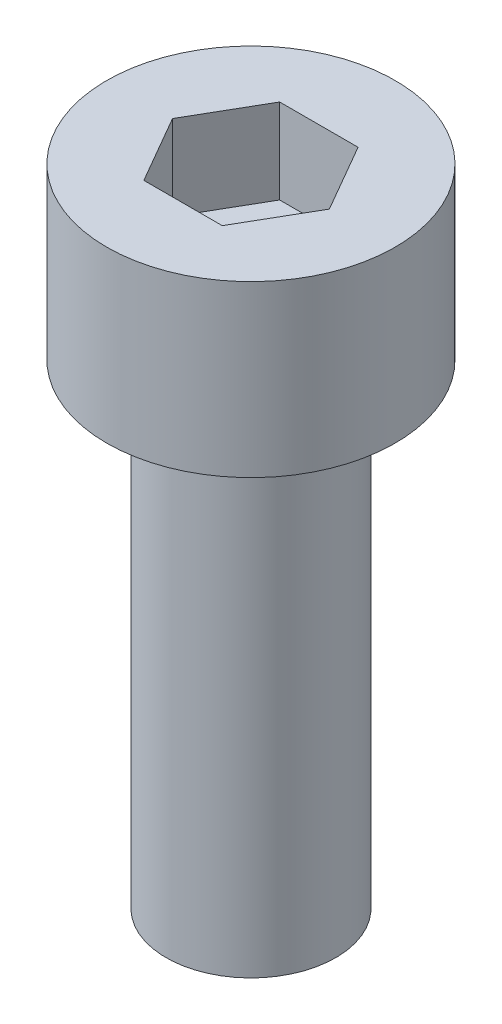
ISO-10303-21;
HEADER;
FILE_DESCRIPTION(('STEP AP214'),'2;1');
FILE_NAME('part.step','',(''),(''),'','','');
FILE_SCHEMA(('AUTOMOTIVE_DESIGN { 1 0 10303 214 1 1 1 1 }'));
ENDSEC;
DATA;
#1=APPLICATION_CONTEXT('core data for automotive mechanical design processes');
#2=APPLICATION_PROTOCOL_DEFINITION('international standard','automotive_design',2000,#1);
#3=PRODUCT_CONTEXT('',#1,'mechanical');
#4=PRODUCT('Part','Part','',(#3));
#5=PRODUCT_RELATED_PRODUCT_CATEGORY('part','',(#4));
#6=PRODUCT_DEFINITION_FORMATION('','',#4);
#7=PRODUCT_DEFINITION_CONTEXT('part definition',#1,'design');
#8=PRODUCT_DEFINITION('design','',#6,#7);
#9=PRODUCT_DEFINITION_SHAPE('','',#8);
#10=(LENGTH_UNIT() NAMED_UNIT(*) SI_UNIT(.MILLI.,.METRE.));
#11=(NAMED_UNIT(*) PLANE_ANGLE_UNIT() SI_UNIT($,.RADIAN.));
#12=(NAMED_UNIT(*) SI_UNIT($,.STERADIAN.) SOLID_ANGLE_UNIT());
#13=UNCERTAINTY_MEASURE_WITH_UNIT(LENGTH_MEASURE(1.E-05),#10,'distance_accuracy_value','');
#14=(GEOMETRIC_REPRESENTATION_CONTEXT(3) GLOBAL_UNCERTAINTY_ASSIGNED_CONTEXT((#13)) GLOBAL_UNIT_ASSIGNED_CONTEXT((#10,
#11,#12)) REPRESENTATION_CONTEXT('',''));
#15=CARTESIAN_POINT('',(0.,0.,0.));
#16=DIRECTION('',(0.,0.,1.));
#17=DIRECTION('',(1.,0.,0.));
#18=AXIS2_PLACEMENT_3D('',#15,#16,#17);
#19=CARTESIAN_POINT('',(0.,5.,0.));
#20=DIRECTION('',(0.,-1.,0.));
#21=DIRECTION('',(0.,0.,-1.));
#22=AXIS2_PLACEMENT_3D('',#19,#20,#21);
#23=CYLINDRICAL_SURFACE('',#22,4.25);
#24=CARTESIAN_POINT('',(0.,5.,0.));
#25=DIRECTION('',(0.,1.,0.));
#26=DIRECTION('',(0.,0.,1.));
#27=AXIS2_PLACEMENT_3D('',#24,#25,#26);
#28=CIRCLE('',#27,4.25);
#29=CARTESIAN_POINT('',(0.,5.,4.25));
#30=VERTEX_POINT('',#29);
#31=EDGE_CURVE('E43',#30,#30,#28,.T.);
#32=ORIENTED_EDGE('',*,*,#31,.F.);
#33=EDGE_LOOP('',(#32));
#34=FACE_BOUND('',#33,.T.);
#35=CARTESIAN_POINT('',(0.,0.,0.));
#36=DIRECTION('',(0.,1.,0.));
#37=DIRECTION('',(0.,0.,1.));
#38=AXIS2_PLACEMENT_3D('',#35,#36,#37);
#39=CIRCLE('',#38,4.25);
#40=CARTESIAN_POINT('',(0.,0.,4.25));
#41=VERTEX_POINT('',#40);
#42=EDGE_CURVE('E38',#41,#41,#39,.T.);
#43=ORIENTED_EDGE('',*,*,#42,.T.);
#44=EDGE_LOOP('',(#43));
#45=FACE_BOUND('',#44,.T.);
#46=ADVANCED_FACE('F35',(#34,#45),#23,.T.);
#47=CARTESIAN_POINT('',(0.,5.,0.));
#48=DIRECTION('',(0.,1.,0.));
#49=DIRECTION('',(0.,0.,1.));
#50=AXIS2_PLACEMENT_3D('',#47,#48,#49);
#51=PLANE('',#50);
#52=DIRECTION('',(0.5,0.,-0.866025403784439));
#53=VECTOR('',#52,1.);
#54=CARTESIAN_POINT('',(1.15470053837925,5.,2.));
#55=LINE('',#54,#53);
#56=CARTESIAN_POINT('',(1.15470053837925,5.,2.));
#57=VERTEX_POINT('',#56);
#58=CARTESIAN_POINT('',(2.3094010767585,5.,0.));
#59=VERTEX_POINT('',#58);
#60=EDGE_CURVE('E51',#57,#59,#55,.T.);
#61=ORIENTED_EDGE('',*,*,#60,.F.);
#62=DIRECTION('',(1.,0.,0.));
#63=VECTOR('',#62,1.);
#64=CARTESIAN_POINT('',(-1.15470053837925,5.,2.));
#65=LINE('',#64,#63);
#66=CARTESIAN_POINT('',(-1.15470053837925,5.,2.));
#67=VERTEX_POINT('',#66);
#68=EDGE_CURVE('E135',#67,#57,#65,.T.);
#69=ORIENTED_EDGE('',*,*,#68,.F.);
#70=DIRECTION('',(0.5,0.,0.866025403784438));
#71=VECTOR('',#70,1.);
#72=CARTESIAN_POINT('',(-2.3094010767585,5.,0.));
#73=LINE('',#72,#71);
#74=CARTESIAN_POINT('',(-2.3094010767585,5.,0.));
#75=VERTEX_POINT('',#74);
#76=EDGE_CURVE('E133',#75,#67,#73,.T.);
#77=ORIENTED_EDGE('',*,*,#76,.F.);
#78=DIRECTION('',(-0.5,0.,0.866025403784439));
#79=VECTOR('',#78,1.);
#80=CARTESIAN_POINT('',(-1.15470053837925,5.,-2.));
#81=LINE('',#80,#79);
#82=CARTESIAN_POINT('',(-1.15470053837925,5.,-2.));
#83=VERTEX_POINT('',#82);
#84=EDGE_CURVE('E99',#83,#75,#81,.T.);
#85=ORIENTED_EDGE('',*,*,#84,.F.);
#86=DIRECTION('',(-1.,0.,0.));
#87=VECTOR('',#86,1.);
#88=CARTESIAN_POINT('',(1.15470053837925,5.,-2.));
#89=LINE('',#88,#87);
#90=CARTESIAN_POINT('',(1.15470053837925,5.,-2.));
#91=VERTEX_POINT('',#90);
#92=EDGE_CURVE('E129',#91,#83,#89,.T.);
#93=ORIENTED_EDGE('',*,*,#92,.F.);
#94=DIRECTION('',(-0.5,0.,-0.866025403784438));
#95=VECTOR('',#94,1.);
#96=CARTESIAN_POINT('',(2.3094010767585,5.,0.));
#97=LINE('',#96,#95);
#98=EDGE_CURVE('E125',#59,#91,#97,.T.);
#99=ORIENTED_EDGE('',*,*,#98,.F.);
#100=EDGE_LOOP('',(#61,#69,#77,#85,#93,#99));
#101=FACE_BOUND('',#100,.T.);
#102=ORIENTED_EDGE('',*,*,#31,.T.);
#103=EDGE_LOOP('',(#102));
#104=FACE_BOUND('',#103,.T.);
#105=ADVANCED_FACE('F153',(#101,#104),#51,.T.);
#106=CARTESIAN_POINT('',(0.,0.,0.));
#107=DIRECTION('',(0.,1.,0.));
#108=DIRECTION('',(0.,0.,1.));
#109=AXIS2_PLACEMENT_3D('',#106,#107,#108);
#110=PLANE('',#109);
#111=CARTESIAN_POINT('',(0.,0.,0.));
#112=DIRECTION('',(0.,-1.,0.));
#113=DIRECTION('',(0.,0.,-1.));
#114=AXIS2_PLACEMENT_3D('',#111,#112,#113);
#115=CIRCLE('',#114,2.5);
#116=CARTESIAN_POINT('',(0.,0.,-2.5));
#117=VERTEX_POINT('',#116);
#118=EDGE_CURVE('E11',#117,#117,#115,.T.);
#119=ORIENTED_EDGE('',*,*,#118,.F.);
#120=EDGE_LOOP('',(#119));
#121=FACE_BOUND('',#120,.T.);
#122=ORIENTED_EDGE('',*,*,#42,.F.);
#123=EDGE_LOOP('',(#122));
#124=FACE_BOUND('',#123,.T.);
#125=ADVANCED_FACE('F150',(#121,#124),#110,.F.);
#126=CARTESIAN_POINT('',(1.15470053837925,2.5,2.));
#127=DIRECTION('',(0.866025403784439,0.,0.5));
#128=DIRECTION('',(0.5,0.,-0.866025403784439));
#129=AXIS2_PLACEMENT_3D('',#126,#127,#128);
#130=PLANE('',#129);
#131=ORIENTED_EDGE('',*,*,#60,.T.);
#132=DIRECTION('',(0.,1.,0.));
#133=VECTOR('',#132,1.);
#134=CARTESIAN_POINT('',(2.3094010767585,2.5,0.));
#135=LINE('',#134,#133);
#136=CARTESIAN_POINT('',(2.3094010767585,2.5,0.));
#137=VERTEX_POINT('',#136);
#138=EDGE_CURVE('E81',#137,#59,#135,.T.);
#139=ORIENTED_EDGE('',*,*,#138,.F.);
#140=DIRECTION('',(0.5,0.,-0.866025403784439));
#141=VECTOR('',#140,1.);
#142=CARTESIAN_POINT('',(1.15470053837925,2.5,2.));
#143=LINE('',#142,#141);
#144=CARTESIAN_POINT('',(1.15470053837925,2.5,2.));
#145=VERTEX_POINT('',#144);
#146=EDGE_CURVE('E137',#145,#137,#143,.T.);
#147=ORIENTED_EDGE('',*,*,#146,.F.);
#148=DIRECTION('',(0.,1.,0.));
#149=VECTOR('',#148,1.);
#150=CARTESIAN_POINT('',(1.15470053837925,2.5,2.));
#151=LINE('',#150,#149);
#152=EDGE_CURVE('E59',#145,#57,#151,.T.);
#153=ORIENTED_EDGE('',*,*,#152,.T.);
#154=EDGE_LOOP('',(#131,#139,#147,#153));
#155=FACE_BOUND('',#154,.T.);
#156=ADVANCED_FACE('F152',(#155),#130,.F.);
#157=CARTESIAN_POINT('',(-1.15470053837925,2.5,2.));
#158=DIRECTION('',(0.,0.,1.));
#159=DIRECTION('',(1.,0.,0.));
#160=AXIS2_PLACEMENT_3D('',#157,#158,#159);
#161=PLANE('',#160);
#162=ORIENTED_EDGE('',*,*,#68,.T.);
#163=ORIENTED_EDGE('',*,*,#152,.F.);
#164=DIRECTION('',(1.,0.,0.));
#165=VECTOR('',#164,1.);
#166=CARTESIAN_POINT('',(-1.15470053837925,2.5,2.));
#167=LINE('',#166,#165);
#168=CARTESIAN_POINT('',(-1.15470053837925,2.5,2.));
#169=VERTEX_POINT('',#168);
#170=EDGE_CURVE('E111',#169,#145,#167,.T.);
#171=ORIENTED_EDGE('',*,*,#170,.F.);
#172=DIRECTION('',(0.,1.,0.));
#173=VECTOR('',#172,1.);
#174=CARTESIAN_POINT('',(-1.15470053837925,2.5,2.));
#175=LINE('',#174,#173);
#176=EDGE_CURVE('E103',#169,#67,#175,.T.);
#177=ORIENTED_EDGE('',*,*,#176,.T.);
#178=EDGE_LOOP('',(#162,#163,#171,#177));
#179=FACE_BOUND('',#178,.T.);
#180=ADVANCED_FACE('F159',(#179),#161,.F.);
#181=CARTESIAN_POINT('',(-2.3094010767585,2.5,0.));
#182=DIRECTION('',(-0.866025403784439,0.,0.5));
#183=DIRECTION('',(0.5,0.,0.866025403784439));
#184=AXIS2_PLACEMENT_3D('',#181,#182,#183);
#185=PLANE('',#184);
#186=ORIENTED_EDGE('',*,*,#76,.T.);
#187=ORIENTED_EDGE('',*,*,#176,.F.);
#188=DIRECTION('',(0.5,0.,0.866025403784438));
#189=VECTOR('',#188,1.);
#190=CARTESIAN_POINT('',(-2.3094010767585,2.5,0.));
#191=LINE('',#190,#189);
#192=CARTESIAN_POINT('',(-2.3094010767585,2.5,0.));
#193=VERTEX_POINT('',#192);
#194=EDGE_CURVE('E107',#193,#169,#191,.T.);
#195=ORIENTED_EDGE('',*,*,#194,.F.);
#196=DIRECTION('',(0.,1.,0.));
#197=VECTOR('',#196,1.);
#198=CARTESIAN_POINT('',(-2.3094010767585,2.5,0.));
#199=LINE('',#198,#197);
#200=EDGE_CURVE('E92',#193,#75,#199,.T.);
#201=ORIENTED_EDGE('',*,*,#200,.T.);
#202=EDGE_LOOP('',(#186,#187,#195,#201));
#203=FACE_BOUND('',#202,.T.);
#204=ADVANCED_FACE('F108',(#203),#185,.F.);
#205=CARTESIAN_POINT('',(-1.15470053837925,2.5,-2.));
#206=DIRECTION('',(-0.866025403784439,0.,-0.5));
#207=DIRECTION('',(-0.5,0.,0.866025403784439));
#208=AXIS2_PLACEMENT_3D('',#205,#206,#207);
#209=PLANE('',#208);
#210=ORIENTED_EDGE('',*,*,#84,.T.);
#211=ORIENTED_EDGE('',*,*,#200,.F.);
#212=DIRECTION('',(-0.5,0.,0.866025403784439));
#213=VECTOR('',#212,1.);
#214=CARTESIAN_POINT('',(-1.15470053837925,2.5,-2.));
#215=LINE('',#214,#213);
#216=CARTESIAN_POINT('',(-1.15470053837925,2.5,-2.));
#217=VERTEX_POINT('',#216);
#218=EDGE_CURVE('E96',#217,#193,#215,.T.);
#219=ORIENTED_EDGE('',*,*,#218,.F.);
#220=DIRECTION('',(0.,1.,0.));
#221=VECTOR('',#220,1.);
#222=CARTESIAN_POINT('',(-1.15470053837925,2.5,-2.));
#223=LINE('',#222,#221);
#224=EDGE_CURVE('E104',#217,#83,#223,.T.);
#225=ORIENTED_EDGE('',*,*,#224,.T.);
#226=EDGE_LOOP('',(#210,#211,#219,#225));
#227=FACE_BOUND('',#226,.T.);
#228=ADVANCED_FACE('F94',(#227),#209,.F.);
#229=CARTESIAN_POINT('',(1.15470053837925,2.5,-2.));
#230=DIRECTION('',(0.,0.,-1.));
#231=DIRECTION('',(-1.,0.,0.));
#232=AXIS2_PLACEMENT_3D('',#229,#230,#231);
#233=PLANE('',#232);
#234=ORIENTED_EDGE('',*,*,#92,.T.);
#235=ORIENTED_EDGE('',*,*,#224,.F.);
#236=DIRECTION('',(-1.,0.,0.));
#237=VECTOR('',#236,1.);
#238=CARTESIAN_POINT('',(1.15470053837925,2.5,-2.));
#239=LINE('',#238,#237);
#240=CARTESIAN_POINT('',(1.15470053837925,2.5,-2.));
#241=VERTEX_POINT('',#240);
#242=EDGE_CURVE('E117',#241,#217,#239,.T.);
#243=ORIENTED_EDGE('',*,*,#242,.F.);
#244=DIRECTION('',(0.,1.,0.));
#245=VECTOR('',#244,1.);
#246=CARTESIAN_POINT('',(1.15470053837925,2.5,-2.));
#247=LINE('',#246,#245);
#248=EDGE_CURVE('E141',#241,#91,#247,.T.);
#249=ORIENTED_EDGE('',*,*,#248,.T.);
#250=EDGE_LOOP('',(#234,#235,#243,#249));
#251=FACE_BOUND('',#250,.T.);
#252=ADVANCED_FACE('F204',(#251),#233,.F.);
#253=CARTESIAN_POINT('',(2.3094010767585,2.5,0.));
#254=DIRECTION('',(0.866025403784438,0.,-0.5));
#255=DIRECTION('',(-0.5,0.,-0.866025403784439));
#256=AXIS2_PLACEMENT_3D('',#253,#254,#255);
#257=PLANE('',#256);
#258=ORIENTED_EDGE('',*,*,#98,.T.);
#259=ORIENTED_EDGE('',*,*,#248,.F.);
#260=DIRECTION('',(-0.5,0.,-0.866025403784438));
#261=VECTOR('',#260,1.);
#262=CARTESIAN_POINT('',(2.3094010767585,2.5,0.));
#263=LINE('',#262,#261);
#264=EDGE_CURVE('E119',#137,#241,#263,.T.);
#265=ORIENTED_EDGE('',*,*,#264,.F.);
#266=ORIENTED_EDGE('',*,*,#138,.T.);
#267=EDGE_LOOP('',(#258,#259,#265,#266));
#268=FACE_BOUND('',#267,.T.);
#269=ADVANCED_FACE('F213',(#268),#257,.F.);
#270=CARTESIAN_POINT('',(0.,2.5,0.));
#271=DIRECTION('',(0.,1.,0.));
#272=DIRECTION('',(0.,0.,1.));
#273=AXIS2_PLACEMENT_3D('',#270,#271,#272);
#274=PLANE('',#273);
#275=ORIENTED_EDGE('',*,*,#146,.T.);
#276=ORIENTED_EDGE('',*,*,#264,.T.);
#277=ORIENTED_EDGE('',*,*,#242,.T.);
#278=ORIENTED_EDGE('',*,*,#218,.T.);
#279=ORIENTED_EDGE('',*,*,#194,.T.);
#280=ORIENTED_EDGE('',*,*,#170,.T.);
#281=EDGE_LOOP('',(#275,#276,#277,#278,#279,#280));
#282=FACE_BOUND('',#281,.T.);
#283=ADVANCED_FACE('F114',(#282),#274,.T.);
#284=CARTESIAN_POINT('',(0.,-14.,0.));
#285=DIRECTION('',(0.,1.,0.));
#286=DIRECTION('',(0.,0.,1.));
#287=AXIS2_PLACEMENT_3D('',#284,#285,#286);
#288=CYLINDRICAL_SURFACE('',#287,2.5);
#289=CARTESIAN_POINT('',(0.,-14.,0.));
#290=DIRECTION('',(0.,-1.,0.));
#291=DIRECTION('',(0.,0.,-1.));
#292=AXIS2_PLACEMENT_3D('',#289,#290,#291);
#293=CIRCLE('',#292,2.5);
#294=CARTESIAN_POINT('',(0.,-14.,-2.5));
#295=VERTEX_POINT('',#294);
#296=EDGE_CURVE('E126',#295,#295,#293,.T.);
#297=ORIENTED_EDGE('',*,*,#296,.F.);
#298=EDGE_LOOP('',(#297));
#299=FACE_BOUND('',#298,.T.);
#300=ORIENTED_EDGE('',*,*,#118,.T.);
#301=EDGE_LOOP('',(#300));
#302=FACE_BOUND('',#301,.T.);
#303=ADVANCED_FACE('F231',(#299,#302),#288,.T.);
#304=CARTESIAN_POINT('',(0.,-14.,0.));
#305=DIRECTION('',(0.,-1.,0.));
#306=DIRECTION('',(0.,0.,-1.));
#307=AXIS2_PLACEMENT_3D('',#304,#305,#306);
#308=PLANE('',#307);
#309=ORIENTED_EDGE('',*,*,#296,.T.);
#310=EDGE_LOOP('',(#309));
#311=FACE_BOUND('',#310,.T.);
#312=ADVANCED_FACE('F244',(#311),#308,.T.);
#313=CLOSED_SHELL('',(#46,#105,#125,#156,#180,#204,#228,#252,#269,#283,#303,#312));
#314=MANIFOLD_SOLID_BREP('B2',#313);
#315=ADVANCED_BREP_SHAPE_REPRESENTATION('',(#18,#314),#14);
#316=SHAPE_DEFINITION_REPRESENTATION(#9,#315);
ENDSEC;
END-ISO-10303-21;
